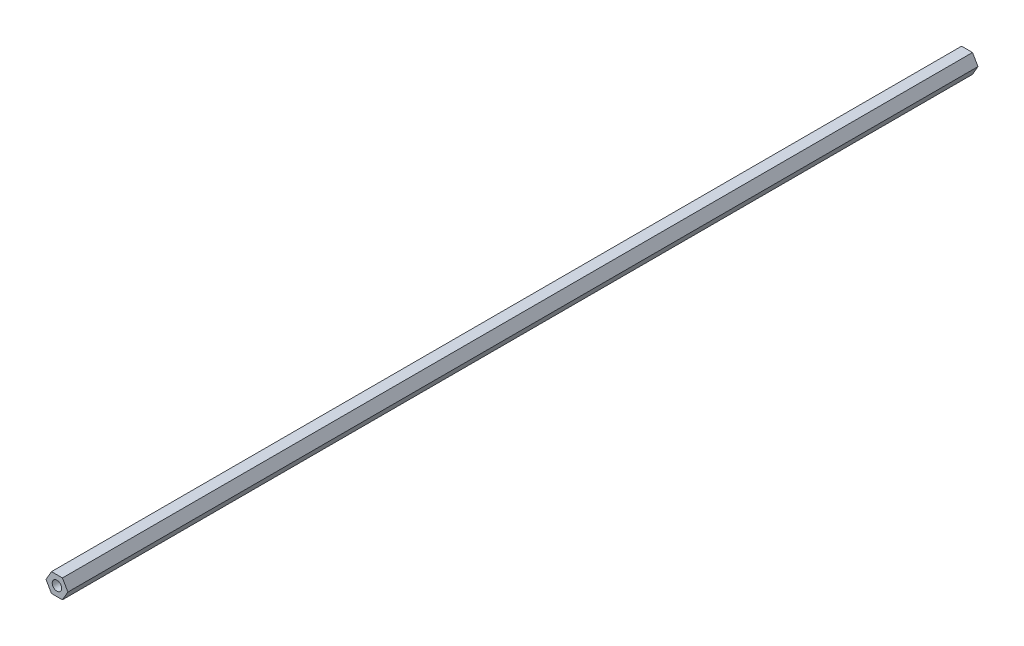
ISO-10303-21;
HEADER;
FILE_DESCRIPTION(('STEP AP214'),'2;1');
FILE_NAME('part.step','',(''),(''),'','','');
FILE_SCHEMA(('AUTOMOTIVE_DESIGN { 1 0 10303 214 1 1 1 1 }'));
ENDSEC;
DATA;
#1=APPLICATION_CONTEXT('core data for automotive mechanical design processes');
#2=APPLICATION_PROTOCOL_DEFINITION('international standard','automotive_design',2000,#1);
#3=PRODUCT_CONTEXT('',#1,'mechanical');
#4=PRODUCT('Part','Part','',(#3));
#5=PRODUCT_RELATED_PRODUCT_CATEGORY('part','',(#4));
#6=PRODUCT_DEFINITION_FORMATION('','',#4);
#7=PRODUCT_DEFINITION_CONTEXT('part definition',#1,'design');
#8=PRODUCT_DEFINITION('design','',#6,#7);
#9=PRODUCT_DEFINITION_SHAPE('','',#8);
#10=(LENGTH_UNIT() NAMED_UNIT(*) SI_UNIT(.MILLI.,.METRE.));
#11=(NAMED_UNIT(*) PLANE_ANGLE_UNIT() SI_UNIT($,.RADIAN.));
#12=(NAMED_UNIT(*) SI_UNIT($,.STERADIAN.) SOLID_ANGLE_UNIT());
#13=UNCERTAINTY_MEASURE_WITH_UNIT(LENGTH_MEASURE(1.E-05),#10,'distance_accuracy_value','');
#14=(GEOMETRIC_REPRESENTATION_CONTEXT(3) GLOBAL_UNCERTAINTY_ASSIGNED_CONTEXT((#13)) GLOBAL_UNIT_ASSIGNED_CONTEXT((#10,
#11,#12)) REPRESENTATION_CONTEXT('',''));
#15=CARTESIAN_POINT('',(0.,0.,0.));
#16=DIRECTION('',(0.,0.,1.));
#17=DIRECTION('',(1.,0.,0.));
#18=AXIS2_PLACEMENT_3D('',#15,#16,#17);
#19=CARTESIAN_POINT('',(0.,0.,609.6));
#20=DIRECTION('',(0.,0.,1.));
#21=DIRECTION('',(1.,0.,0.));
#22=AXIS2_PLACEMENT_3D('',#19,#20,#21);
#23=PLANE('',#22);
#24=DIRECTION('',(-1.,0.,0.));
#25=VECTOR('',#24,1.);
#26=CARTESIAN_POINT('',(3.66617420935413,6.35,609.6));
#27=LINE('',#26,#25);
#28=CARTESIAN_POINT('',(3.66617420935413,6.35,609.6));
#29=VERTEX_POINT('',#28);
#30=CARTESIAN_POINT('',(-3.66617420935412,6.35,609.6));
#31=VERTEX_POINT('',#30);
#32=EDGE_CURVE('E136',#29,#31,#27,.T.);
#33=ORIENTED_EDGE('',*,*,#32,.T.);
#34=DIRECTION('',(-0.5,-0.866025403784439,0.));
#35=VECTOR('',#34,1.);
#36=CARTESIAN_POINT('',(-3.66617420935412,6.35,609.6));
#37=LINE('',#36,#35);
#38=CARTESIAN_POINT('',(-7.33234841870825,0.,609.6));
#39=VERTEX_POINT('',#38);
#40=EDGE_CURVE('E94',#31,#39,#37,.T.);
#41=ORIENTED_EDGE('',*,*,#40,.T.);
#42=DIRECTION('',(0.5,-0.866025403784438,0.));
#43=VECTOR('',#42,1.);
#44=CARTESIAN_POINT('',(-7.33234841870825,0.,609.6));
#45=LINE('',#44,#43);
#46=CARTESIAN_POINT('',(-3.66617420935412,-6.35,609.6));
#47=VERTEX_POINT('',#46);
#48=EDGE_CURVE('E107',#39,#47,#45,.T.);
#49=ORIENTED_EDGE('',*,*,#48,.T.);
#50=DIRECTION('',(1.,0.,0.));
#51=VECTOR('',#50,1.);
#52=CARTESIAN_POINT('',(-3.66617420935412,-6.35,609.6));
#53=LINE('',#52,#51);
#54=CARTESIAN_POINT('',(3.66617420935413,-6.35,609.6));
#55=VERTEX_POINT('',#54);
#56=EDGE_CURVE('E101',#47,#55,#53,.T.);
#57=ORIENTED_EDGE('',*,*,#56,.T.);
#58=DIRECTION('',(0.5,0.866025403784439,0.));
#59=VECTOR('',#58,1.);
#60=CARTESIAN_POINT('',(3.66617420935413,-6.35,609.6));
#61=LINE('',#60,#59);
#62=CARTESIAN_POINT('',(7.33234841870825,0.,609.6));
#63=VERTEX_POINT('',#62);
#64=EDGE_CURVE('E105',#55,#63,#61,.T.);
#65=ORIENTED_EDGE('',*,*,#64,.T.);
#66=DIRECTION('',(-0.5,0.866025403784439,0.));
#67=VECTOR('',#66,1.);
#68=CARTESIAN_POINT('',(7.33234841870825,0.,609.6));
#69=LINE('',#68,#67);
#70=EDGE_CURVE('E57',#63,#29,#69,.T.);
#71=ORIENTED_EDGE('',*,*,#70,.T.);
#72=EDGE_LOOP('',(#33,#41,#49,#57,#65,#71));
#73=FACE_BOUND('',#72,.T.);
#74=CARTESIAN_POINT('',(0.,0.,609.6));
#75=DIRECTION('',(0.,0.,1.));
#76=DIRECTION('',(1.,0.,0.));
#77=AXIS2_PLACEMENT_3D('',#74,#75,#76);
#78=CIRCLE('',#77,3.175);
#79=CARTESIAN_POINT('',(3.175,0.,609.6));
#80=VERTEX_POINT('',#79);
#81=EDGE_CURVE('E129',#80,#80,#78,.T.);
#82=ORIENTED_EDGE('',*,*,#81,.F.);
#83=EDGE_LOOP('',(#82));
#84=FACE_BOUND('',#83,.T.);
#85=ADVANCED_FACE('F40',(#73,#84),#23,.T.);
#86=CARTESIAN_POINT('',(0.,0.,0.));
#87=DIRECTION('',(0.,0.,1.));
#88=DIRECTION('',(1.,0.,0.));
#89=AXIS2_PLACEMENT_3D('',#86,#87,#88);
#90=PLANE('',#89);
#91=DIRECTION('',(-1.,0.,0.));
#92=VECTOR('',#91,1.);
#93=CARTESIAN_POINT('',(3.66617420935413,6.35,0.));
#94=LINE('',#93,#92);
#95=CARTESIAN_POINT('',(3.66617420935413,6.35,0.));
#96=VERTEX_POINT('',#95);
#97=CARTESIAN_POINT('',(-3.66617420935412,6.35,0.));
#98=VERTEX_POINT('',#97);
#99=EDGE_CURVE('E125',#96,#98,#94,.T.);
#100=ORIENTED_EDGE('',*,*,#99,.F.);
#101=DIRECTION('',(-0.5,0.866025403784439,0.));
#102=VECTOR('',#101,1.);
#103=CARTESIAN_POINT('',(7.33234841870825,0.,0.));
#104=LINE('',#103,#102);
#105=CARTESIAN_POINT('',(7.33234841870825,0.,0.));
#106=VERTEX_POINT('',#105);
#107=EDGE_CURVE('E86',#106,#96,#104,.T.);
#108=ORIENTED_EDGE('',*,*,#107,.F.);
#109=DIRECTION('',(0.5,0.866025403784439,0.));
#110=VECTOR('',#109,1.);
#111=CARTESIAN_POINT('',(3.66617420935413,-6.35,0.));
#112=LINE('',#111,#110);
#113=CARTESIAN_POINT('',(3.66617420935413,-6.35,0.));
#114=VERTEX_POINT('',#113);
#115=EDGE_CURVE('E80',#114,#106,#112,.T.);
#116=ORIENTED_EDGE('',*,*,#115,.F.);
#117=DIRECTION('',(1.,0.,0.));
#118=VECTOR('',#117,1.);
#119=CARTESIAN_POINT('',(-3.66617420935412,-6.35,0.));
#120=LINE('',#119,#118);
#121=CARTESIAN_POINT('',(-3.66617420935412,-6.35,0.));
#122=VERTEX_POINT('',#121);
#123=EDGE_CURVE('E115',#122,#114,#120,.T.);
#124=ORIENTED_EDGE('',*,*,#123,.F.);
#125=DIRECTION('',(0.5,-0.866025403784438,0.));
#126=VECTOR('',#125,1.);
#127=CARTESIAN_POINT('',(-7.33234841870825,0.,0.));
#128=LINE('',#127,#126);
#129=CARTESIAN_POINT('',(-7.33234841870825,0.,0.));
#130=VERTEX_POINT('',#129);
#131=EDGE_CURVE('E131',#130,#122,#128,.T.);
#132=ORIENTED_EDGE('',*,*,#131,.F.);
#133=DIRECTION('',(-0.5,-0.866025403784439,0.));
#134=VECTOR('',#133,1.);
#135=CARTESIAN_POINT('',(-3.66617420935412,6.35,0.));
#136=LINE('',#135,#134);
#137=EDGE_CURVE('E128',#98,#130,#136,.T.);
#138=ORIENTED_EDGE('',*,*,#137,.F.);
#139=EDGE_LOOP('',(#100,#108,#116,#124,#132,#138));
#140=FACE_BOUND('',#139,.T.);
#141=CARTESIAN_POINT('',(0.,0.,0.));
#142=DIRECTION('',(0.,0.,1.));
#143=DIRECTION('',(1.,0.,0.));
#144=AXIS2_PLACEMENT_3D('',#141,#142,#143);
#145=CIRCLE('',#144,3.175);
#146=CARTESIAN_POINT('',(3.175,0.,0.));
#147=VERTEX_POINT('',#146);
#148=EDGE_CURVE('E247',#147,#147,#145,.T.);
#149=ORIENTED_EDGE('',*,*,#148,.T.);
#150=EDGE_LOOP('',(#149));
#151=FACE_BOUND('',#150,.T.);
#152=ADVANCED_FACE('F145',(#140,#151),#90,.F.);
#153=CARTESIAN_POINT('',(3.66617420935413,6.35,609.6));
#154=DIRECTION('',(0.,-1.,0.));
#155=DIRECTION('',(1.,0.,0.));
#156=AXIS2_PLACEMENT_3D('',#153,#154,#155);
#157=PLANE('',#156);
#158=ORIENTED_EDGE('',*,*,#99,.T.);
#159=DIRECTION('',(0.,0.,-1.));
#160=VECTOR('',#159,1.);
#161=CARTESIAN_POINT('',(-3.66617420935412,6.35,609.6));
#162=LINE('',#161,#160);
#163=EDGE_CURVE('E11',#31,#98,#162,.T.);
#164=ORIENTED_EDGE('',*,*,#163,.F.);
#165=ORIENTED_EDGE('',*,*,#32,.F.);
#166=DIRECTION('',(0.,0.,-1.));
#167=VECTOR('',#166,1.);
#168=CARTESIAN_POINT('',(3.66617420935413,6.35,609.6));
#169=LINE('',#168,#167);
#170=EDGE_CURVE('E121',#29,#96,#169,.T.);
#171=ORIENTED_EDGE('',*,*,#170,.T.);
#172=EDGE_LOOP('',(#158,#164,#165,#171));
#173=FACE_BOUND('',#172,.T.);
#174=ADVANCED_FACE('F42',(#173),#157,.F.);
#175=CARTESIAN_POINT('',(-3.66617420935412,6.35,609.6));
#176=DIRECTION('',(0.866025403784439,-0.5,0.));
#177=DIRECTION('',(0.5,0.866025403784438,0.));
#178=AXIS2_PLACEMENT_3D('',#175,#176,#177);
#179=PLANE('',#178);
#180=ORIENTED_EDGE('',*,*,#137,.T.);
#181=DIRECTION('',(0.,0.,-1.));
#182=VECTOR('',#181,1.);
#183=CARTESIAN_POINT('',(-7.33234841870825,0.,609.6));
#184=LINE('',#183,#182);
#185=EDGE_CURVE('E49',#39,#130,#184,.T.);
#186=ORIENTED_EDGE('',*,*,#185,.F.);
#187=ORIENTED_EDGE('',*,*,#40,.F.);
#188=ORIENTED_EDGE('',*,*,#163,.T.);
#189=EDGE_LOOP('',(#180,#186,#187,#188));
#190=FACE_BOUND('',#189,.T.);
#191=ADVANCED_FACE('F170',(#190),#179,.F.);
#192=CARTESIAN_POINT('',(-7.33234841870825,0.,609.6));
#193=DIRECTION('',(0.866025403784439,0.5,0.));
#194=DIRECTION('',(-0.5,0.866025403784438,0.));
#195=AXIS2_PLACEMENT_3D('',#192,#193,#194);
#196=PLANE('',#195);
#197=ORIENTED_EDGE('',*,*,#131,.T.);
#198=DIRECTION('',(0.,0.,-1.));
#199=VECTOR('',#198,1.);
#200=CARTESIAN_POINT('',(-3.66617420935412,-6.35,609.6));
#201=LINE('',#200,#199);
#202=EDGE_CURVE('E116',#47,#122,#201,.T.);
#203=ORIENTED_EDGE('',*,*,#202,.F.);
#204=ORIENTED_EDGE('',*,*,#48,.F.);
#205=ORIENTED_EDGE('',*,*,#185,.T.);
#206=EDGE_LOOP('',(#197,#203,#204,#205));
#207=FACE_BOUND('',#206,.T.);
#208=ADVANCED_FACE('F142',(#207),#196,.F.);
#209=CARTESIAN_POINT('',(-3.66617420935412,-6.35,609.6));
#210=DIRECTION('',(0.,1.,0.));
#211=DIRECTION('',(0.,0.,1.));
#212=AXIS2_PLACEMENT_3D('',#209,#210,#211);
#213=PLANE('',#212);
#214=ORIENTED_EDGE('',*,*,#123,.T.);
#215=DIRECTION('',(0.,0.,-1.));
#216=VECTOR('',#215,1.);
#217=CARTESIAN_POINT('',(3.66617420935413,-6.35,609.6));
#218=LINE('',#217,#216);
#219=EDGE_CURVE('E112',#55,#114,#218,.T.);
#220=ORIENTED_EDGE('',*,*,#219,.F.);
#221=ORIENTED_EDGE('',*,*,#56,.F.);
#222=ORIENTED_EDGE('',*,*,#202,.T.);
#223=EDGE_LOOP('',(#214,#220,#221,#222));
#224=FACE_BOUND('',#223,.T.);
#225=ADVANCED_FACE('F113',(#224),#213,.F.);
#226=CARTESIAN_POINT('',(3.66617420935413,-6.35,609.6));
#227=DIRECTION('',(-0.866025403784439,0.5,0.));
#228=DIRECTION('',(-0.5,-0.866025403784439,0.));
#229=AXIS2_PLACEMENT_3D('',#226,#227,#228);
#230=PLANE('',#229);
#231=ORIENTED_EDGE('',*,*,#115,.T.);
#232=DIRECTION('',(0.,0.,-1.));
#233=VECTOR('',#232,1.);
#234=CARTESIAN_POINT('',(7.33234841870825,0.,609.6));
#235=LINE('',#234,#233);
#236=EDGE_CURVE('E117',#63,#106,#235,.T.);
#237=ORIENTED_EDGE('',*,*,#236,.F.);
#238=ORIENTED_EDGE('',*,*,#64,.F.);
#239=ORIENTED_EDGE('',*,*,#219,.T.);
#240=EDGE_LOOP('',(#231,#237,#238,#239));
#241=FACE_BOUND('',#240,.T.);
#242=ADVANCED_FACE('F119',(#241),#230,.F.);
#243=CARTESIAN_POINT('',(7.33234841870825,0.,609.6));
#244=DIRECTION('',(-0.866025403784439,-0.5,0.));
#245=DIRECTION('',(0.5,-0.866025403784438,0.));
#246=AXIS2_PLACEMENT_3D('',#243,#244,#245);
#247=PLANE('',#246);
#248=ORIENTED_EDGE('',*,*,#107,.T.);
#249=ORIENTED_EDGE('',*,*,#170,.F.);
#250=ORIENTED_EDGE('',*,*,#70,.F.);
#251=ORIENTED_EDGE('',*,*,#236,.T.);
#252=EDGE_LOOP('',(#248,#249,#250,#251));
#253=FACE_BOUND('',#252,.T.);
#254=ADVANCED_FACE('F150',(#253),#247,.F.);
#255=CARTESIAN_POINT('',(0.,0.,609.6));
#256=DIRECTION('',(0.,0.,-1.));
#257=DIRECTION('',(-1.,0.,0.));
#258=AXIS2_PLACEMENT_3D('',#255,#256,#257);
#259=CYLINDRICAL_SURFACE('',#258,3.175);
#260=ORIENTED_EDGE('',*,*,#81,.T.);
#261=EDGE_LOOP('',(#260));
#262=FACE_BOUND('',#261,.T.);
#263=ORIENTED_EDGE('',*,*,#148,.F.);
#264=EDGE_LOOP('',(#263));
#265=FACE_BOUND('',#264,.T.);
#266=ADVANCED_FACE('F152',(#262,#265),#259,.F.);
#267=CLOSED_SHELL('',(#85,#152,#174,#191,#208,#225,#242,#254,#266));
#268=MANIFOLD_SOLID_BREP('B2',#267);
#269=ADVANCED_BREP_SHAPE_REPRESENTATION('',(#18,#268),#14);
#270=SHAPE_DEFINITION_REPRESENTATION(#9,#269);
ENDSEC;
END-ISO-10303-21;
